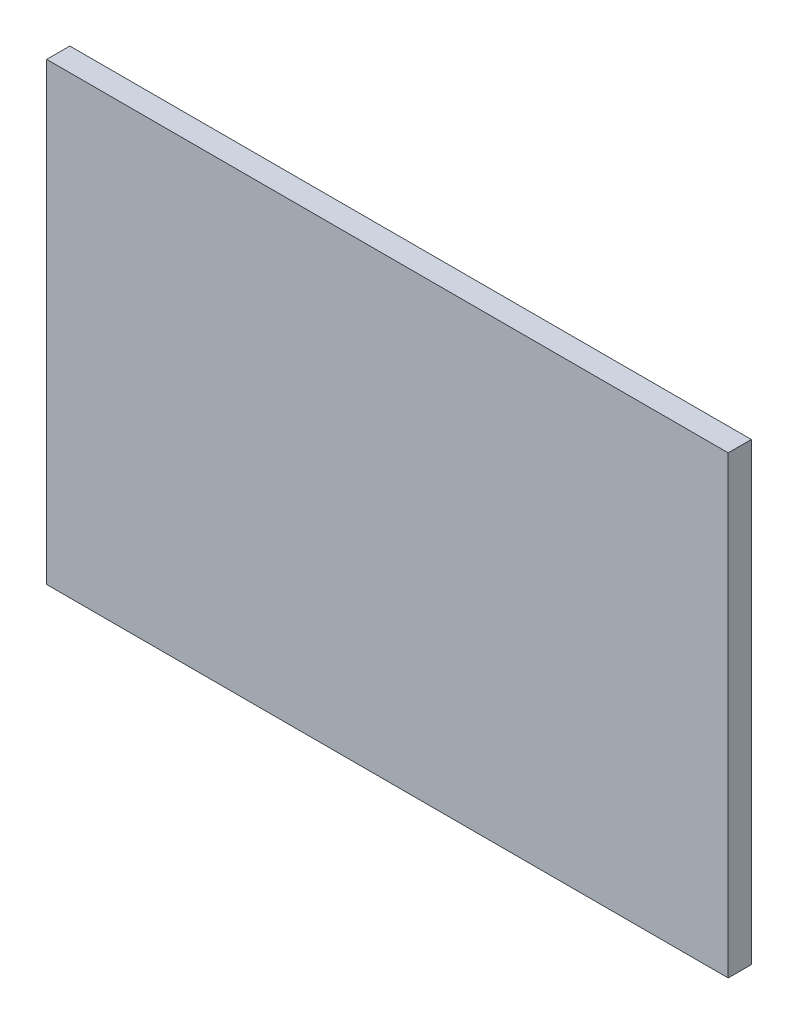
ISO-10303-21;
HEADER;
FILE_DESCRIPTION(('STEP AP214'),'2;1');
FILE_NAME('part.step','',(''),(''),'','','');
FILE_SCHEMA(('AUTOMOTIVE_DESIGN { 1 0 10303 214 1 1 1 1 }'));
ENDSEC;
DATA;
#1=APPLICATION_CONTEXT('core data for automotive mechanical design processes');
#2=APPLICATION_PROTOCOL_DEFINITION('international standard','automotive_design',2000,#1);
#3=PRODUCT_CONTEXT('',#1,'mechanical');
#4=PRODUCT('Part','Part','',(#3));
#5=PRODUCT_RELATED_PRODUCT_CATEGORY('part','',(#4));
#6=PRODUCT_DEFINITION_FORMATION('','',#4);
#7=PRODUCT_DEFINITION_CONTEXT('part definition',#1,'design');
#8=PRODUCT_DEFINITION('design','',#6,#7);
#9=PRODUCT_DEFINITION_SHAPE('','',#8);
#10=(LENGTH_UNIT() NAMED_UNIT(*) SI_UNIT(.MILLI.,.METRE.));
#11=(NAMED_UNIT(*) PLANE_ANGLE_UNIT() SI_UNIT($,.RADIAN.));
#12=(NAMED_UNIT(*) SI_UNIT($,.STERADIAN.) SOLID_ANGLE_UNIT());
#13=UNCERTAINTY_MEASURE_WITH_UNIT(LENGTH_MEASURE(1.E-05),#10,'distance_accuracy_value','');
#14=(GEOMETRIC_REPRESENTATION_CONTEXT(3) GLOBAL_UNCERTAINTY_ASSIGNED_CONTEXT((#13)) GLOBAL_UNIT_ASSIGNED_CONTEXT((#10,
#11,#12)) REPRESENTATION_CONTEXT('',''));
#15=CARTESIAN_POINT('',(0.,0.,0.));
#16=DIRECTION('',(0.,0.,1.));
#17=DIRECTION('',(1.,0.,0.));
#18=AXIS2_PLACEMENT_3D('',#15,#16,#17);
#19=CARTESIAN_POINT('',(-1.473,0.983,0.1));
#20=DIRECTION('',(0.,0.,1.));
#21=DIRECTION('',(1.,0.,0.));
#22=AXIS2_PLACEMENT_3D('',#19,#20,#21);
#23=PLANE('',#22);
#24=DIRECTION('',(0.,1.,0.));
#25=VECTOR('',#24,1.);
#26=CARTESIAN_POINT('',(1.473,0.983,0.1));
#27=LINE('',#26,#25);
#28=CARTESIAN_POINT('',(1.473,0.983,0.1));
#29=VERTEX_POINT('',#28);
#30=CARTESIAN_POINT('',(1.473,-0.983,0.1));
#31=VERTEX_POINT('',#30);
#32=EDGE_CURVE('E53',#29,#31,#27,.F.);
#33=ORIENTED_EDGE('',*,*,#32,.F.);
#34=DIRECTION('',(1.,0.,0.));
#35=VECTOR('',#34,1.);
#36=CARTESIAN_POINT('',(-1.473,0.983,0.1));
#37=LINE('',#36,#35);
#38=CARTESIAN_POINT('',(-1.473,0.983,0.1));
#39=VERTEX_POINT('',#38);
#40=EDGE_CURVE('E68',#39,#29,#37,.T.);
#41=ORIENTED_EDGE('',*,*,#40,.F.);
#42=DIRECTION('',(0.,1.,0.));
#43=VECTOR('',#42,1.);
#44=CARTESIAN_POINT('',(-1.473,-0.983,0.1));
#45=LINE('',#44,#43);
#46=CARTESIAN_POINT('',(-1.473,-0.983,0.1));
#47=VERTEX_POINT('',#46);
#48=EDGE_CURVE('E20',#47,#39,#45,.T.);
#49=ORIENTED_EDGE('',*,*,#48,.F.);
#50=DIRECTION('',(1.,0.,0.));
#51=VECTOR('',#50,1.);
#52=CARTESIAN_POINT('',(1.473,-0.983,0.1));
#53=LINE('',#52,#51);
#54=EDGE_CURVE('E58',#31,#47,#53,.F.);
#55=ORIENTED_EDGE('',*,*,#54,.F.);
#56=EDGE_LOOP('',(#33,#41,#49,#55));
#57=FACE_BOUND('',#56,.T.);
#58=ADVANCED_FACE('F17',(#57),#23,.T.);
#59=CARTESIAN_POINT('',(-1.473,-0.983,0.));
#60=DIRECTION('',(-1.,0.,0.));
#61=DIRECTION('',(0.,0.,1.));
#62=AXIS2_PLACEMENT_3D('',#59,#60,#61);
#63=PLANE('',#62);
#64=DIRECTION('',(0.,0.,1.));
#65=VECTOR('',#64,1.);
#66=CARTESIAN_POINT('',(-1.473,0.983,0.));
#67=LINE('',#66,#65);
#68=CARTESIAN_POINT('',(-1.473,0.983,0.));
#69=VERTEX_POINT('',#68);
#70=EDGE_CURVE('E79',#69,#39,#67,.T.);
#71=ORIENTED_EDGE('',*,*,#70,.F.);
#72=DIRECTION('',(0.,1.,0.));
#73=VECTOR('',#72,1.);
#74=CARTESIAN_POINT('',(-1.473,0.983,0.));
#75=LINE('',#74,#73);
#76=CARTESIAN_POINT('',(-1.473,-0.983,0.));
#77=VERTEX_POINT('',#76);
#78=EDGE_CURVE('E74',#69,#77,#75,.F.);
#79=ORIENTED_EDGE('',*,*,#78,.T.);
#80=DIRECTION('',(0.,0.,-1.));
#81=VECTOR('',#80,1.);
#82=CARTESIAN_POINT('',(-1.473,-0.983,0.));
#83=LINE('',#82,#81);
#84=EDGE_CURVE('E63',#47,#77,#83,.T.);
#85=ORIENTED_EDGE('',*,*,#84,.F.);
#86=ORIENTED_EDGE('',*,*,#48,.T.);
#87=EDGE_LOOP('',(#71,#79,#85,#86));
#88=FACE_BOUND('',#87,.T.);
#89=ADVANCED_FACE('F73',(#88),#63,.T.);
#90=CARTESIAN_POINT('',(1.473,-0.983,0.));
#91=DIRECTION('',(0.,-1.,0.));
#92=DIRECTION('',(0.,0.,-1.));
#93=AXIS2_PLACEMENT_3D('',#90,#91,#92);
#94=PLANE('',#93);
#95=ORIENTED_EDGE('',*,*,#84,.T.);
#96=DIRECTION('',(1.,0.,0.));
#97=VECTOR('',#96,1.);
#98=CARTESIAN_POINT('',(-1.473,-0.983,0.));
#99=LINE('',#98,#97);
#100=CARTESIAN_POINT('',(1.473,-0.983,0.));
#101=VERTEX_POINT('',#100);
#102=EDGE_CURVE('E84',#77,#101,#99,.T.);
#103=ORIENTED_EDGE('',*,*,#102,.T.);
#104=DIRECTION('',(0.,0.,-1.));
#105=VECTOR('',#104,1.);
#106=CARTESIAN_POINT('',(1.473,-0.983,0.));
#107=LINE('',#106,#105);
#108=EDGE_CURVE('E65',#31,#101,#107,.T.);
#109=ORIENTED_EDGE('',*,*,#108,.F.);
#110=ORIENTED_EDGE('',*,*,#54,.T.);
#111=EDGE_LOOP('',(#95,#103,#109,#110));
#112=FACE_BOUND('',#111,.T.);
#113=ADVANCED_FACE('F60',(#112),#94,.T.);
#114=CARTESIAN_POINT('',(1.473,0.983,0.));
#115=DIRECTION('',(1.,0.,0.));
#116=DIRECTION('',(0.,0.,-1.));
#117=AXIS2_PLACEMENT_3D('',#114,#115,#116);
#118=PLANE('',#117);
#119=ORIENTED_EDGE('',*,*,#108,.T.);
#120=DIRECTION('',(0.,1.,0.));
#121=VECTOR('',#120,1.);
#122=CARTESIAN_POINT('',(1.473,0.983,0.));
#123=LINE('',#122,#121);
#124=CARTESIAN_POINT('',(1.473,0.983,0.));
#125=VERTEX_POINT('',#124);
#126=EDGE_CURVE('E26',#101,#125,#123,.T.);
#127=ORIENTED_EDGE('',*,*,#126,.T.);
#128=DIRECTION('',(0.,0.,1.));
#129=VECTOR('',#128,1.);
#130=CARTESIAN_POINT('',(1.473,0.983,0.));
#131=LINE('',#130,#129);
#132=EDGE_CURVE('E34',#29,#125,#131,.F.);
#133=ORIENTED_EDGE('',*,*,#132,.F.);
#134=ORIENTED_EDGE('',*,*,#32,.T.);
#135=EDGE_LOOP('',(#119,#127,#133,#134));
#136=FACE_BOUND('',#135,.T.);
#137=ADVANCED_FACE('F88',(#136),#118,.T.);
#138=CARTESIAN_POINT('',(-1.473,0.983,0.));
#139=DIRECTION('',(0.,1.,0.));
#140=DIRECTION('',(0.,0.,1.));
#141=AXIS2_PLACEMENT_3D('',#138,#139,#140);
#142=PLANE('',#141);
#143=ORIENTED_EDGE('',*,*,#132,.T.);
#144=DIRECTION('',(1.,0.,0.));
#145=VECTOR('',#144,1.);
#146=CARTESIAN_POINT('',(-1.473,0.983,0.));
#147=LINE('',#146,#145);
#148=EDGE_CURVE('E11',#125,#69,#147,.F.);
#149=ORIENTED_EDGE('',*,*,#148,.T.);
#150=ORIENTED_EDGE('',*,*,#70,.T.);
#151=ORIENTED_EDGE('',*,*,#40,.T.);
#152=EDGE_LOOP('',(#143,#149,#150,#151));
#153=FACE_BOUND('',#152,.T.);
#154=ADVANCED_FACE('F91',(#153),#142,.T.);
#155=CARTESIAN_POINT('',(-1.473,0.983,0.));
#156=DIRECTION('',(0.,0.,1.));
#157=DIRECTION('',(1.,0.,0.));
#158=AXIS2_PLACEMENT_3D('',#155,#156,#157);
#159=PLANE('',#158);
#160=ORIENTED_EDGE('',*,*,#126,.F.);
#161=ORIENTED_EDGE('',*,*,#102,.F.);
#162=ORIENTED_EDGE('',*,*,#78,.F.);
#163=ORIENTED_EDGE('',*,*,#148,.F.);
#164=EDGE_LOOP('',(#160,#161,#162,#163));
#165=FACE_BOUND('',#164,.T.);
#166=ADVANCED_FACE('F90',(#165),#159,.F.);
#167=CLOSED_SHELL('',(#58,#89,#113,#137,#154,#166));
#168=MANIFOLD_SOLID_BREP('B1',#167);
#169=ADVANCED_BREP_SHAPE_REPRESENTATION('',(#18,#168),#14);
#170=SHAPE_DEFINITION_REPRESENTATION(#9,#169);
ENDSEC;
END-ISO-10303-21;
